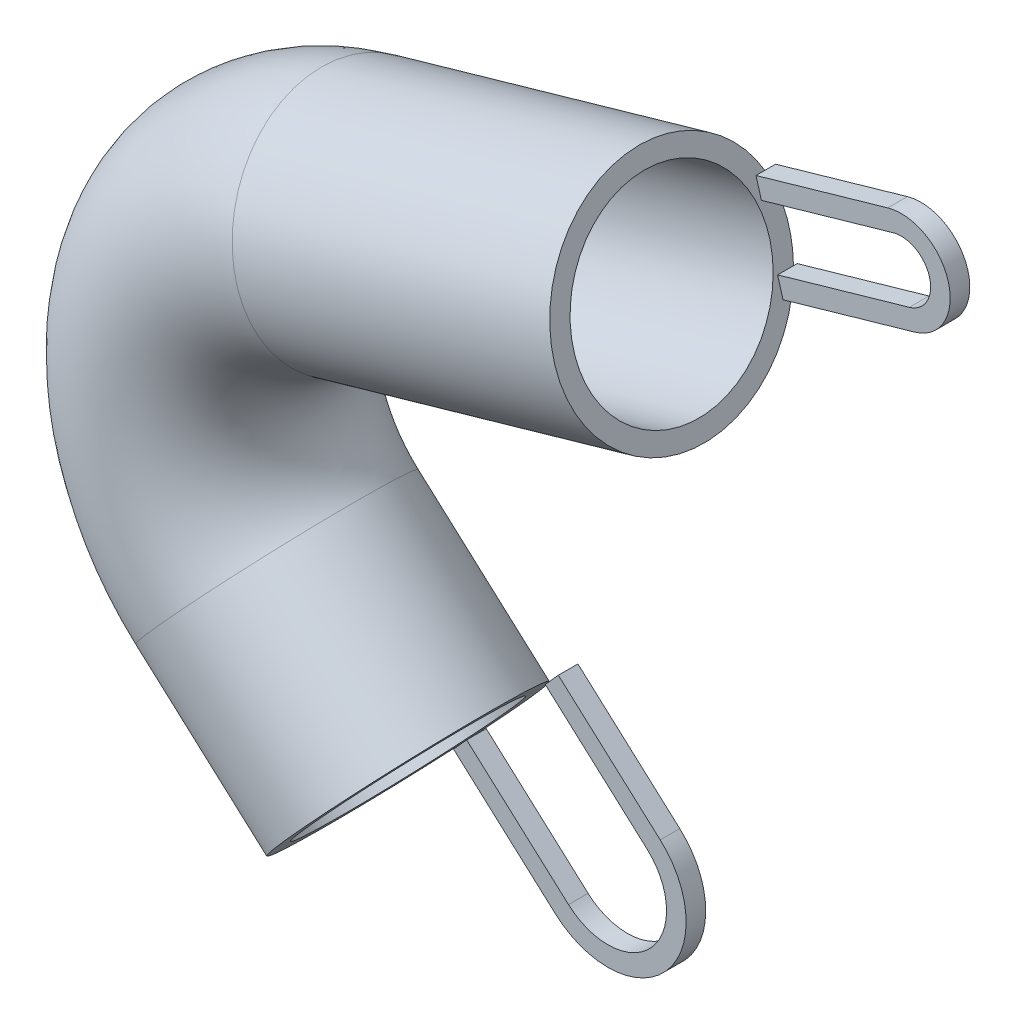
ISO-10303-21;
HEADER;
FILE_DESCRIPTION(('STEP AP214'),'2;1');
FILE_NAME('part.step','',(''),(''),'','','');
FILE_SCHEMA(('AUTOMOTIVE_DESIGN { 1 0 10303 214 1 1 1 1 }'));
ENDSEC;
DATA;
#1=APPLICATION_CONTEXT('core data for automotive mechanical design processes');
#2=APPLICATION_PROTOCOL_DEFINITION('international standard','automotive_design',2000,#1);
#3=PRODUCT_CONTEXT('',#1,'mechanical');
#4=PRODUCT('Part','Part','',(#3));
#5=PRODUCT_RELATED_PRODUCT_CATEGORY('part','',(#4));
#6=PRODUCT_DEFINITION_FORMATION('','',#4);
#7=PRODUCT_DEFINITION_CONTEXT('part definition',#1,'design');
#8=PRODUCT_DEFINITION('design','',#6,#7);
#9=PRODUCT_DEFINITION_SHAPE('','',#8);
#10=(LENGTH_UNIT() NAMED_UNIT(*) SI_UNIT(.MILLI.,.METRE.));
#11=(NAMED_UNIT(*) PLANE_ANGLE_UNIT() SI_UNIT($,.RADIAN.));
#12=(NAMED_UNIT(*) SI_UNIT($,.STERADIAN.) SOLID_ANGLE_UNIT());
#13=UNCERTAINTY_MEASURE_WITH_UNIT(LENGTH_MEASURE(1.E-05),#10,'distance_accuracy_value','');
#14=(GEOMETRIC_REPRESENTATION_CONTEXT(3) GLOBAL_UNCERTAINTY_ASSIGNED_CONTEXT((#13)) GLOBAL_UNIT_ASSIGNED_CONTEXT((#10,
#11,#12)) REPRESENTATION_CONTEXT('',''));
#15=CARTESIAN_POINT('',(0.,0.,0.));
#16=DIRECTION('',(0.,0.,1.));
#17=DIRECTION('',(1.,0.,0.));
#18=AXIS2_PLACEMENT_3D('',#15,#16,#17);
#19=CARTESIAN_POINT('',(0.,-13.4536240470737,0.));
#20=DIRECTION('',(0.743294146247166,-0.66896473162245,0.));
#21=DIRECTION('',(0.66896473162245,0.743294146247166,0.));
#22=AXIS2_PLACEMENT_3D('',#19,#20,#21);
#23=PLANE('',#22);
#24=DIRECTION('',(0.,0.,-1.));
#25=VECTOR('',#24,1.);
#26=CARTESIAN_POINT('',(-2.00689419486735,-15.6835064858152,-5.));
#27=LINE('',#26,#25);
#28=CARTESIAN_POINT('',(-2.00689419486735,-15.6835064858152,-5.));
#29=VERTEX_POINT('',#28);
#30=CARTESIAN_POINT('',(-2.00689419486735,-15.6835064858152,-5.19615242270663));
#31=VERTEX_POINT('',#30);
#32=EDGE_CURVE('E244',#29,#31,#27,.T.);
#33=ORIENTED_EDGE('',*,*,#32,.T.);
#34=CARTESIAN_POINT('',(0.,-13.4536240470737,0.));
#35=DIRECTION('',(0.743294146247166,-0.66896473162245,0.));
#36=DIRECTION('',(0.66896473162245,0.743294146247166,0.));
#37=AXIS2_PLACEMENT_3D('',#34,#35,#36);
#38=CIRCLE('',#37,6.);
#39=CARTESIAN_POINT('',(2.00689419486735,-11.2237416083322,-5.19615242270663));
#40=VERTEX_POINT('',#39);
#41=EDGE_CURVE('E338',#31,#40,#38,.T.);
#42=ORIENTED_EDGE('',*,*,#41,.T.);
#43=DIRECTION('',(0.,0.,-1.));
#44=VECTOR('',#43,1.);
#45=CARTESIAN_POINT('',(2.00689419486735,-11.2237416083322,-5.));
#46=LINE('',#45,#44);
#47=CARTESIAN_POINT('',(2.00689419486735,-11.2237416083322,-5.));
#48=VERTEX_POINT('',#47);
#49=EDGE_CURVE('E69',#48,#40,#46,.T.);
#50=ORIENTED_EDGE('',*,*,#49,.F.);
#51=DIRECTION('',(-0.66896473162245,-0.743294146247166,0.));
#52=VECTOR('',#51,1.);
#53=CARTESIAN_POINT('',(6.68964731622449,-6.02068258460205,-5.));
#54=LINE('',#53,#52);
#55=CARTESIAN_POINT('',(2.21870501277246,-10.9883962551043,-5.));
#56=VERTEX_POINT('',#55);
#57=EDGE_CURVE('E193',#56,#48,#54,.T.);
#58=ORIENTED_EDGE('',*,*,#57,.F.);
#59=CARTESIAN_POINT('',(-2.21870501277247,-15.9188518390431,-5.));
#60=VERTEX_POINT('',#59);
#61=EDGE_CURVE('E330',#56,#60,#38,.T.);
#62=ORIENTED_EDGE('',*,*,#61,.T.);
#63=EDGE_CURVE('E62',#29,#60,#54,.T.);
#64=ORIENTED_EDGE('',*,*,#63,.F.);
#65=EDGE_LOOP('',(#33,#42,#50,#58,#62,#64));
#66=FACE_BOUND('',#65,.T.);
#67=CARTESIAN_POINT('',(0.,-13.4536240470737,0.));
#68=DIRECTION('',(0.743294146247166,-0.66896473162245,0.));
#69=DIRECTION('',(0.66896473162245,0.743294146247166,0.));
#70=AXIS2_PLACEMENT_3D('',#67,#68,#69);
#71=CIRCLE('',#70,5.);
#72=CARTESIAN_POINT('',(-3.34482365811225,-17.1700947783095,0.));
#73=VERTEX_POINT('',#72);
#74=EDGE_CURVE('E298',#73,#73,#71,.T.);
#75=ORIENTED_EDGE('',*,*,#74,.F.);
#76=EDGE_LOOP('',(#75));
#77=FACE_BOUND('',#76,.T.);
#78=ADVANCED_FACE('F46',(#66,#77),#23,.T.);
#79=CARTESIAN_POINT('',(13.4605647921205,14.2666666688236,0.));
#80=DIRECTION('',(-0.961200154136361,-0.275851887229788,0.));
#81=DIRECTION('',(0.275851887229788,-0.961200154136361,0.));
#82=AXIS2_PLACEMENT_3D('',#79,#80,#81);
#83=PLANE('',#82);
#84=CARTESIAN_POINT('',(13.4605647921205,14.2666666688236,0.));
#85=DIRECTION('',(-0.961200154136361,-0.275851887229788,0.));
#86=DIRECTION('',(0.275851887229788,-0.961200154136361,0.));
#87=AXIS2_PLACEMENT_3D('',#84,#85,#86);
#88=CIRCLE('',#87,5.);
#89=CARTESIAN_POINT('',(12.0813053559716,19.0726674395054,0.));
#90=VERTEX_POINT('',#89);
#91=EDGE_CURVE('E327',#90,#90,#88,.T.);
#92=ORIENTED_EDGE('',*,*,#91,.T.);
#93=EDGE_LOOP('',(#92));
#94=FACE_BOUND('',#93,.T.);
#95=DIRECTION('',(0.,0.,-1.));
#96=VECTOR('',#95,1.);
#97=CARTESIAN_POINT('',(12.7709350740461,16.6696670541643,-5.));
#98=LINE('',#97,#96);
#99=CARTESIAN_POINT('',(12.7709350740461,16.6696670541643,-5.));
#100=VERTEX_POINT('',#99);
#101=CARTESIAN_POINT('',(12.7709350740461,16.6696670541643,-5.45435605731795));
#102=VERTEX_POINT('',#101);
#103=EDGE_CURVE('E310',#100,#102,#98,.T.);
#104=ORIENTED_EDGE('',*,*,#103,.T.);
#105=CARTESIAN_POINT('',(13.4605647921205,14.2666666688236,0.));
#106=DIRECTION('',(-0.961200154136361,-0.275851887229788,0.));
#107=DIRECTION('',(0.275851887229788,-0.961200154136361,0.));
#108=AXIS2_PLACEMENT_3D('',#105,#106,#107);
#109=CIRCLE('',#108,6.);
#110=CARTESIAN_POINT('',(14.1501945101949,11.8636662834829,-5.45435605731796));
#111=VERTEX_POINT('',#110);
#112=EDGE_CURVE('E55',#111,#102,#109,.T.);
#113=ORIENTED_EDGE('',*,*,#112,.F.);
#114=DIRECTION('',(0.,0.,-1.));
#115=VECTOR('',#114,1.);
#116=CARTESIAN_POINT('',(14.1501945101949,11.8636662834829,-5.));
#117=LINE('',#116,#115);
#118=CARTESIAN_POINT('',(14.1501945101949,11.8636662834829,-5.));
#119=VERTEX_POINT('',#118);
#120=EDGE_CURVE('E303',#119,#111,#117,.T.);
#121=ORIENTED_EDGE('',*,*,#120,.F.);
#122=DIRECTION('',(0.275851887229788,-0.961200154136361,0.));
#123=VECTOR('',#122,1.);
#124=CARTESIAN_POINT('',(16.2190836644184,4.65466512745994,-5.));
#125=LINE('',#124,#123);
#126=CARTESIAN_POINT('',(13.8743426229652,12.824866437619,-5.));
#127=VERTEX_POINT('',#126);
#128=EDGE_CURVE('E265',#127,#119,#125,.T.);
#129=ORIENTED_EDGE('',*,*,#128,.F.);
#130=DIRECTION('',(0.,0.,-1.));
#131=VECTOR('',#130,1.);
#132=CARTESIAN_POINT('',(13.8743426229652,12.824866437619,-5.));
#133=LINE('',#132,#131);
#134=CARTESIAN_POINT('',(13.8743426229652,12.824866437619,-5.80947501931112));
#135=VERTEX_POINT('',#134);
#136=EDGE_CURVE('E299',#127,#135,#133,.T.);
#137=ORIENTED_EDGE('',*,*,#136,.T.);
#138=CARTESIAN_POINT('',(13.0467869612758,15.7084669000281,-5.80947501931112));
#139=VERTEX_POINT('',#138);
#140=EDGE_CURVE('E54',#139,#135,#109,.T.);
#141=ORIENTED_EDGE('',*,*,#140,.F.);
#142=DIRECTION('',(0.,0.,-1.));
#143=VECTOR('',#142,1.);
#144=CARTESIAN_POINT('',(13.0467869612758,15.7084669000281,-5.));
#145=LINE('',#144,#143);
#146=CARTESIAN_POINT('',(13.0467869612758,15.7084669000281,-5.));
#147=VERTEX_POINT('',#146);
#148=EDGE_CURVE('E314',#147,#139,#145,.T.);
#149=ORIENTED_EDGE('',*,*,#148,.F.);
#150=EDGE_CURVE('E262',#100,#147,#125,.T.);
#151=ORIENTED_EDGE('',*,*,#150,.F.);
#152=EDGE_LOOP('',(#104,#113,#121,#129,#137,#141,#149,#151));
#153=FACE_BOUND('',#152,.T.);
#154=ADVANCED_FACE('F382',(#94,#153),#83,.F.);
#155=CARTESIAN_POINT('',(0.,-13.4536240470737,0.));
#156=DIRECTION('',(-0.743294146247166,0.66896473162245,0.));
#157=DIRECTION('',(-0.66896473162245,-0.743294146247166,0.));
#158=AXIS2_PLACEMENT_3D('',#155,#156,#157);
#159=CYLINDRICAL_SURFACE('',#158,6.);
#160=CARTESIAN_POINT('',(-6.6896473162245,-7.43294146247166,0.));
#161=DIRECTION('',(-0.743294146247166,0.66896473162245,0.));
#162=DIRECTION('',(-0.66896473162245,-0.743294146247166,0.));
#163=AXIS2_PLACEMENT_3D('',#160,#161,#162);
#164=CIRCLE('',#163,6.);
#165=CARTESIAN_POINT('',(-10.7034357059592,-11.8927063399547,0.));
#166=VERTEX_POINT('',#165);
#167=EDGE_CURVE('E331',#166,#166,#164,.F.);
#168=ORIENTED_EDGE('',*,*,#167,.T.);
#169=EDGE_LOOP('',(#168));
#170=FACE_BOUND('',#169,.T.);
#171=EDGE_CURVE('E335',#60,#31,#38,.T.);
#172=ORIENTED_EDGE('',*,*,#171,.F.);
#173=ORIENTED_EDGE('',*,*,#61,.F.);
#174=EDGE_CURVE('E343',#40,#56,#38,.T.);
#175=ORIENTED_EDGE('',*,*,#174,.F.);
#176=ORIENTED_EDGE('',*,*,#41,.F.);
#177=EDGE_LOOP('',(#172,#173,#175,#176));
#178=FACE_BOUND('',#177,.T.);
#179=ADVANCED_FACE('F387',(#170,#178),#159,.T.);
#180=CARTESIAN_POINT('',(0.,0.,0.));
#181=DIRECTION('',(0.,0.,-1.));
#182=DIRECTION('',(-1.,0.,0.));
#183=AXIS2_PLACEMENT_3D('',#180,#181,#182);
#184=TOROIDAL_SURFACE('',#183,10.,6.);
#185=CARTESIAN_POINT('',(-2.75851887229788,9.61200154136361,0.));
#186=DIRECTION('',(-0.961200154136361,-0.275851887229788,0.));
#187=DIRECTION('',(0.275851887229788,-0.961200154136361,0.));
#188=AXIS2_PLACEMENT_3D('',#185,#186,#187);
#189=CIRCLE('',#188,6.);
#190=CARTESIAN_POINT('',(-4.41363019567661,15.3792024661818,0.));
#191=VERTEX_POINT('',#190);
#192=EDGE_CURVE('E334',#191,#191,#189,.T.);
#193=CARTESIAN_POINT('',(0.,0.,0.));
#194=DIRECTION('',(0.,0.,-1.));
#195=DIRECTION('',(-1.,0.,0.));
#196=AXIS2_PLACEMENT_3D('',#193,#194,#195);
#197=CIRCLE('',#196,16.);
#198=EDGE_CURVE('',#166,#191,#197,.T.);
#199=ORIENTED_EDGE('',*,*,#167,.F.);
#200=ORIENTED_EDGE('',*,*,#192,.T.);
#201=ORIENTED_EDGE('',*,*,#198,.T.);
#202=ORIENTED_EDGE('',*,*,#198,.F.);
#203=EDGE_LOOP('',(#199,#201,#200,#202));
#204=FACE_BOUND('',#203,.T.);
#205=ADVANCED_FACE('F394',(#204),#184,.T.);
#206=CARTESIAN_POINT('',(-2.75851887229789,9.61200154136361,0.));
#207=DIRECTION('',(0.961200154136361,0.275851887229789,0.));
#208=DIRECTION('',(-0.275851887229789,0.961200154136361,0.));
#209=AXIS2_PLACEMENT_3D('',#206,#207,#208);
#210=CYLINDRICAL_SURFACE('',#209,6.);
#211=EDGE_CURVE('E12',#102,#139,#109,.T.);
#212=ORIENTED_EDGE('',*,*,#211,.T.);
#213=ORIENTED_EDGE('',*,*,#140,.T.);
#214=EDGE_CURVE('E457',#135,#111,#109,.T.);
#215=ORIENTED_EDGE('',*,*,#214,.T.);
#216=ORIENTED_EDGE('',*,*,#112,.T.);
#217=EDGE_LOOP('',(#212,#213,#215,#216));
#218=FACE_BOUND('',#217,.T.);
#219=ORIENTED_EDGE('',*,*,#192,.F.);
#220=EDGE_LOOP('',(#219));
#221=FACE_BOUND('',#220,.T.);
#222=ADVANCED_FACE('F48',(#218,#221),#210,.T.);
#223=CARTESIAN_POINT('',(0.,-13.4536240470737,0.));
#224=DIRECTION('',(-0.743294146247166,0.66896473162245,0.));
#225=DIRECTION('',(-0.66896473162245,-0.743294146247166,0.));
#226=AXIS2_PLACEMENT_3D('',#223,#224,#225);
#227=CYLINDRICAL_SURFACE('',#226,5.);
#228=CARTESIAN_POINT('',(-6.6896473162245,-7.43294146247166,0.));
#229=DIRECTION('',(0.743294146247166,-0.66896473162245,0.));
#230=DIRECTION('',(0.66896473162245,0.743294146247166,0.));
#231=AXIS2_PLACEMENT_3D('',#228,#229,#230);
#232=CIRCLE('',#231,5.);
#233=CARTESIAN_POINT('',(-10.0344709743367,-11.1494121937075,0.));
#234=VERTEX_POINT('',#233);
#235=EDGE_CURVE('E321',#234,#234,#232,.T.);
#236=CARTESIAN_POINT('',(-10.0344709743367,-11.1494121937075,0.));
#237=CARTESIAN_POINT('',(-9.96478714812608,-11.2121276372971,0.));
#238=CARTESIAN_POINT('',(-9.89510332191541,-11.2748430808867,0.));
#239=CARTESIAN_POINT('',(-9.75573566949406,-11.4002739680659,0.));
#240=CARTESIAN_POINT('',(-9.68605184328339,-11.4629894116555,0.));
#241=CARTESIAN_POINT('',(-9.54668419086205,-11.5884202988347,0.));
#242=CARTESIAN_POINT('',(-9.47700036465137,-11.6511357424243,0.));
#243=CARTESIAN_POINT('',(-9.33763271223003,-11.7765666296035,0.));
#244=CARTESIAN_POINT('',(-9.26794888601936,-11.8392820731931,0.));
#245=CARTESIAN_POINT('',(-9.12858123359801,-11.9647129603723,0.));
#246=CARTESIAN_POINT('',(-9.05889740738734,-12.027428403962,0.));
#247=CARTESIAN_POINT('',(-8.919529754966,-12.1528592911412,0.));
#248=CARTESIAN_POINT('',(-8.84984592875533,-12.2155747347308,0.));
#249=CARTESIAN_POINT('',(-8.71047827633398,-12.34100562191,0.));
#250=CARTESIAN_POINT('',(-8.64079445012331,-12.4037210654996,0.));
#251=CARTESIAN_POINT('',(-8.50142679770197,-12.5291519526788,0.));
#252=CARTESIAN_POINT('',(-8.4317429714913,-12.5918673962684,0.));
#253=CARTESIAN_POINT('',(-8.29237531906995,-12.7172982834476,0.));
#254=CARTESIAN_POINT('',(-8.22269149285928,-12.7800137270372,0.));
#255=CARTESIAN_POINT('',(-8.08332384043794,-12.9054446142164,0.));
#256=CARTESIAN_POINT('',(-8.01364001422727,-12.968160057806,0.));
#257=CARTESIAN_POINT('',(-7.87427236180592,-13.0935909449852,0.));
#258=CARTESIAN_POINT('',(-7.80458853559525,-13.1563063885748,0.));
#259=CARTESIAN_POINT('',(-7.66522088317391,-13.281737275754,0.));
#260=CARTESIAN_POINT('',(-7.59553705696323,-13.3444527193437,0.));
#261=CARTESIAN_POINT('',(-7.45616940454189,-13.4698836065229,0.));
#262=CARTESIAN_POINT('',(-7.38648557833122,-13.5325990501125,0.));
#263=CARTESIAN_POINT('',(-7.24711792590988,-13.6580299372917,0.));
#264=CARTESIAN_POINT('',(-7.1774340996992,-13.7207453808813,0.));
#265=CARTESIAN_POINT('',(-7.03806644727786,-13.8461762680605,0.));
#266=CARTESIAN_POINT('',(-6.96838262106719,-13.9088917116501,0.));
#267=CARTESIAN_POINT('',(-6.82901496864584,-14.0343225988293,0.));
#268=CARTESIAN_POINT('',(-6.75933114243517,-14.0970380424189,0.));
#269=CARTESIAN_POINT('',(-6.61996349001383,-14.2224689295981,0.));
#270=CARTESIAN_POINT('',(-6.55027966380316,-14.2851843731877,0.));
#271=CARTESIAN_POINT('',(-6.41091201138181,-14.4106152603669,0.));
#272=CARTESIAN_POINT('',(-6.34122818517114,-14.4733307039565,0.));
#273=CARTESIAN_POINT('',(-6.2018605327498,-14.5987615911357,0.));
#274=CARTESIAN_POINT('',(-6.13217670653913,-14.6614770347253,0.));
#275=CARTESIAN_POINT('',(-5.99280905411778,-14.7869079219046,0.));
#276=CARTESIAN_POINT('',(-5.92312522790711,-14.8496233654942,0.));
#277=CARTESIAN_POINT('',(-5.78375757548577,-14.9750542526734,0.));
#278=CARTESIAN_POINT('',(-5.7140737492751,-15.037769696263,0.));
#279=CARTESIAN_POINT('',(-5.57470609685375,-15.1632005834422,0.));
#280=CARTESIAN_POINT('',(-5.50502227064308,-15.2259160270318,0.));
#281=CARTESIAN_POINT('',(-5.36565461822174,-15.351346914211,0.));
#282=CARTESIAN_POINT('',(-5.29597079201106,-15.4140623578006,0.));
#283=CARTESIAN_POINT('',(-5.15660313958972,-15.5394932449798,0.));
#284=CARTESIAN_POINT('',(-5.08691931337905,-15.6022086885694,0.));
#285=CARTESIAN_POINT('',(-4.94755166095771,-15.7276395757486,0.));
#286=CARTESIAN_POINT('',(-4.87786783474703,-15.7903550193382,0.));
#287=CARTESIAN_POINT('',(-4.73850018232569,-15.9157859065174,0.));
#288=CARTESIAN_POINT('',(-4.66881635611502,-15.978501350107,0.));
#289=CARTESIAN_POINT('',(-4.52944870369367,-16.1039322372863,0.));
#290=CARTESIAN_POINT('',(-4.459764877483,-16.1666476808759,0.));
#291=CARTESIAN_POINT('',(-4.32039722506166,-16.2920785680551,0.));
#292=CARTESIAN_POINT('',(-4.25071339885099,-16.3547940116447,0.));
#293=CARTESIAN_POINT('',(-4.11134574642964,-16.4802248988239,0.));
#294=CARTESIAN_POINT('',(-4.04166192021897,-16.5429403424135,0.));
#295=CARTESIAN_POINT('',(-3.90229426779763,-16.6683712295927,0.));
#296=CARTESIAN_POINT('',(-3.83261044158696,-16.7310866731823,0.));
#297=CARTESIAN_POINT('',(-3.69324278916561,-16.8565175603615,0.));
#298=CARTESIAN_POINT('',(-3.62355896295494,-16.9192330039511,0.));
#299=CARTESIAN_POINT('',(-3.4841913105336,-17.0446638911303,0.));
#300=CARTESIAN_POINT('',(-3.41450748432293,-17.1073793347199,0.));
#301=CARTESIAN_POINT('',(-3.34482365811225,-17.1700947783095,0.));
#302=B_SPLINE_CURVE_WITH_KNOTS('',3,(#236,#237,#238,#239,#240,#241,#242,#243,#244,#245,#246,
#247,#248,#249,#250,#251,#252,#253,#254,#255,#256,#257,#258,#259,#260,#261,#262,#263,#264,#265,
#266,#267,#268,#269,#270,#271,#272,#273,#274,#275,#276,#277,#278,#279,#280,#281,#282,#283,#284,
#285,#286,#287,#288,#289,#290,#291,#292,#293,#294,#295,#296,#297,#298,#299,#300,#301),
.UNSPECIFIED.,.F.,.F.,(4,2,2,2,2,2,2,2,2,2,2,2,2,2,2,2,2,2,2,2,2,2,2,2,2,2,2,2,2,2,2,2,4),(0.,
0.281250000000001,0.5625,0.843750000000001,1.125,1.40625,1.6875,1.96875,2.25,2.53125,2.8125,
3.09375,3.375,3.65625,3.9375,4.21875,4.5,4.78125,5.0625,5.34375,5.625,5.90625,6.1875,6.46875,
6.75,7.03125,7.3125,7.59375,7.875,8.15625,8.4375,8.71875,9.),.UNSPECIFIED.);
#303=EDGE_CURVE('BSEAM402',#234,#73,#302,.T.);
#304=ORIENTED_EDGE('',*,*,#235,.F.);
#305=ORIENTED_EDGE('',*,*,#74,.T.);
#306=ORIENTED_EDGE('',*,*,#303,.T.);
#307=ORIENTED_EDGE('',*,*,#303,.F.);
#308=EDGE_LOOP('',(#304,#306,#305,#307));
#309=FACE_BOUND('',#308,.T.);
#310=ADVANCED_FACE('F402',(#309),#227,.F.);
#311=CARTESIAN_POINT('',(0.,0.,0.));
#312=DIRECTION('',(0.,0.,-1.));
#313=DIRECTION('',(-1.,0.,0.));
#314=AXIS2_PLACEMENT_3D('',#311,#312,#313);
#315=TOROIDAL_SURFACE('',#314,10.,5.);
#316=CARTESIAN_POINT('',(-2.75851887229788,9.6120015413636,0.));
#317=DIRECTION('',(-0.961200154136361,-0.275851887229788,0.));
#318=DIRECTION('',(0.275851887229788,-0.961200154136361,0.));
#319=AXIS2_PLACEMENT_3D('',#316,#317,#318);
#320=CIRCLE('',#319,5.);
#321=CARTESIAN_POINT('',(-4.13777830844682,14.4180023120454,0.));
#322=VERTEX_POINT('',#321);
#323=EDGE_CURVE('E324',#322,#322,#320,.T.);
#324=CARTESIAN_POINT('',(0.,0.,0.));
#325=DIRECTION('',(0.,0.,-1.));
#326=DIRECTION('',(-1.,0.,0.));
#327=AXIS2_PLACEMENT_3D('',#324,#325,#326);
#328=CIRCLE('',#327,15.);
#329=EDGE_CURVE('',#234,#322,#328,.T.);
#330=ORIENTED_EDGE('',*,*,#235,.T.);
#331=ORIENTED_EDGE('',*,*,#323,.F.);
#332=ORIENTED_EDGE('',*,*,#329,.T.);
#333=ORIENTED_EDGE('',*,*,#329,.F.);
#334=EDGE_LOOP('',(#330,#332,#331,#333));
#335=FACE_BOUND('',#334,.T.);
#336=ADVANCED_FACE('F411',(#335),#315,.F.);
#337=CARTESIAN_POINT('',(-2.75851887229789,9.61200154136361,0.));
#338=DIRECTION('',(0.961200154136361,0.275851887229789,0.));
#339=DIRECTION('',(-0.275851887229789,0.961200154136361,0.));
#340=AXIS2_PLACEMENT_3D('',#337,#338,#339);
#341=CYLINDRICAL_SURFACE('',#340,5.);
#342=CARTESIAN_POINT('',(12.0813053559716,19.0726674395054,0.));
#343=CARTESIAN_POINT('',(11.9123565678005,19.0241813444277,0.));
#344=CARTESIAN_POINT('',(11.7434077796295,18.9756952493499,0.));
#345=CARTESIAN_POINT('',(11.4055102032875,18.8787230591945,0.));
#346=CARTESIAN_POINT('',(11.2365614151164,18.8302369641168,0.));
#347=CARTESIAN_POINT('',(10.8986638387744,18.7332647739614,0.));
#348=CARTESIAN_POINT('',(10.7297150506034,18.6847786788837,0.));
#349=CARTESIAN_POINT('',(10.3918174742613,18.5878064887283,0.));
#350=CARTESIAN_POINT('',(10.2228686860903,18.5393203936506,0.));
#351=CARTESIAN_POINT('',(9.88497110974825,18.4423482034952,0.));
#352=CARTESIAN_POINT('',(9.71602232157722,18.3938621084175,0.));
#353=CARTESIAN_POINT('',(9.37812474523517,18.296889918262,0.));
#354=CARTESIAN_POINT('',(9.20917595706415,18.2484038231843,0.));
#355=CARTESIAN_POINT('',(8.8712783807221,18.1514316330289,0.));
#356=CARTESIAN_POINT('',(8.70232959255107,18.1029455379512,0.));
#357=CARTESIAN_POINT('',(8.36443201620902,18.0059733477958,0.));
#358=CARTESIAN_POINT('',(8.195483228038,17.9574872527181,0.));
#359=CARTESIAN_POINT('',(7.85758565169595,17.8605150625627,0.));
#360=CARTESIAN_POINT('',(7.68863686352492,17.812028967485,0.));
#361=CARTESIAN_POINT('',(7.35073928718287,17.7150567773295,0.));
#362=CARTESIAN_POINT('',(7.18179049901185,17.6665706822518,0.));
#363=CARTESIAN_POINT('',(6.8438929226698,17.5695984920964,0.));
#364=CARTESIAN_POINT('',(6.67494413449877,17.5211123970187,0.));
#365=CARTESIAN_POINT('',(6.33704655815672,17.4241402068633,0.));
#366=CARTESIAN_POINT('',(6.1680977699857,17.3756541117856,0.));
#367=CARTESIAN_POINT('',(5.83020019364365,17.2786819216302,0.));
#368=CARTESIAN_POINT('',(5.66125140547262,17.2301958265525,0.));
#369=CARTESIAN_POINT('',(5.32335382913057,17.1332236363971,0.));
#370=CARTESIAN_POINT('',(5.15440504095955,17.0847375413193,0.));
#371=CARTESIAN_POINT('',(4.8165074646175,16.9877653511639,0.));
#372=CARTESIAN_POINT('',(4.64755867644647,16.9392792560862,0.));
#373=CARTESIAN_POINT('',(4.30966110010443,16.8423070659308,0.));
#374=CARTESIAN_POINT('',(4.1407123119334,16.7938209708531,0.));
#375=CARTESIAN_POINT('',(3.80281473559135,16.6968487806977,0.));
#376=CARTESIAN_POINT('',(3.63386594742032,16.64836268562,0.));
#377=CARTESIAN_POINT('',(3.29596837107827,16.5513904954646,0.));
#378=CARTESIAN_POINT('',(3.12701958290725,16.5029044003868,0.));
#379=CARTESIAN_POINT('',(2.7891220065652,16.4059322102314,0.));
#380=CARTESIAN_POINT('',(2.62017321839418,16.3574461151537,0.));
#381=CARTESIAN_POINT('',(2.28227564205213,16.2604739249983,0.));
#382=CARTESIAN_POINT('',(2.1133268538811,16.2119878299206,0.));
#383=CARTESIAN_POINT('',(1.77542927753905,16.1150156397652,0.));
#384=CARTESIAN_POINT('',(1.60648048936803,16.0665295446875,0.));
#385=CARTESIAN_POINT('',(1.26858291302598,15.9695573545321,0.));
#386=CARTESIAN_POINT('',(1.09963412485495,15.9210712594544,0.));
#387=CARTESIAN_POINT('',(0.761736548512902,15.8240990692989,0.));
#388=CARTESIAN_POINT('',(0.592787760341877,15.7756129742212,0.));
#389=CARTESIAN_POINT('',(0.254890183999827,15.6786407840658,0.));
#390=CARTESIAN_POINT('',(0.0859413958288017,15.6301546889881,0.));
#391=CARTESIAN_POINT('',(-0.251956180513248,15.5331824988327,0.));
#392=CARTESIAN_POINT('',(-0.420904968684273,15.484696403755,0.));
#393=CARTESIAN_POINT('',(-0.758802545026323,15.3877242135996,0.));
#394=CARTESIAN_POINT('',(-0.927751333197348,15.3392381185219,0.));
#395=CARTESIAN_POINT('',(-1.2656489095394,15.2422659283664,0.));
#396=CARTESIAN_POINT('',(-1.43459769771042,15.1937798332887,0.));
#397=CARTESIAN_POINT('',(-1.77249527405247,15.0968076431333,0.));
#398=CARTESIAN_POINT('',(-1.9414440622235,15.0483215480556,0.));
#399=CARTESIAN_POINT('',(-2.27934163856555,14.9513493579002,0.));
#400=CARTESIAN_POINT('',(-2.44829042673657,14.9028632628225,0.));
#401=CARTESIAN_POINT('',(-2.78618800307862,14.8058910726671,0.));
#402=CARTESIAN_POINT('',(-2.95513679124965,14.7574049775894,0.));
#403=CARTESIAN_POINT('',(-3.2930343675917,14.660432787434,0.));
#404=CARTESIAN_POINT('',(-3.46198315576272,14.6119466923562,0.));
#405=CARTESIAN_POINT('',(-3.79988073210477,14.5149745022008,0.));
#406=CARTESIAN_POINT('',(-3.9688295202758,14.4664884071231,0.));
#407=CARTESIAN_POINT('',(-4.13777830844682,14.4180023120454,0.));
#408=B_SPLINE_CURVE_WITH_KNOTS('',3,(#342,#343,#344,#345,#346,#347,#348,#349,#350,#351,#352,
#353,#354,#355,#356,#357,#358,#359,#360,#361,#362,#363,#364,#365,#366,#367,#368,#369,#370,#371,
#372,#373,#374,#375,#376,#377,#378,#379,#380,#381,#382,#383,#384,#385,#386,#387,#388,#389,#390,
#391,#392,#393,#394,#395,#396,#397,#398,#399,#400,#401,#402,#403,#404,#405,#406,#407),
.UNSPECIFIED.,.F.,.F.,(4,2,2,2,2,2,2,2,2,2,2,2,2,2,2,2,2,2,2,2,2,2,2,2,2,2,2,2,2,2,2,2,4),(0.,
0.527305746188187,1.05461149237638,1.58191723856456,2.10922298475275,2.63652873094094,
3.16383447712912,3.69114022331731,4.2184459695055,4.74575171569369,5.27305746188188,
5.80036320807006,6.32766895425825,6.85497470044644,7.38228044663463,7.90958619282281,
8.436891939011,8.96419768519919,9.49150343138738,10.0188091775756,10.5461149237638,
11.0734206699519,11.6007264161401,12.1280321623283,12.6553379085165,13.1826436547047,
13.7099494008929,14.2372551470811,14.7645608932693,15.2918666394574,15.8191723856456,
16.3464781318338,16.873783878022),.UNSPECIFIED.);
#409=EDGE_CURVE('BSEAM396',#90,#322,#408,.T.);
#410=ORIENTED_EDGE('',*,*,#91,.F.);
#411=ORIENTED_EDGE('',*,*,#323,.T.);
#412=ORIENTED_EDGE('',*,*,#409,.T.);
#413=ORIENTED_EDGE('',*,*,#409,.F.);
#414=EDGE_LOOP('',(#410,#412,#411,#413));
#415=FACE_BOUND('',#414,.T.);
#416=ADVANCED_FACE('F396',(#415),#341,.F.);
#417=CARTESIAN_POINT('',(20.188965871075,16.1976298794321,-5.));
#418=DIRECTION('',(0.,0.,-1.));
#419=DIRECTION('',(-1.,0.,0.));
#420=AXIS2_PLACEMENT_3D('',#417,#418,#419);
#421=CYLINDRICAL_SURFACE('',#420,1.5);
#422=CARTESIAN_POINT('',(20.188965871075,16.1976298794321,-6.));
#423=DIRECTION('',(0.,0.,-1.));
#424=DIRECTION('',(-1.,0.,0.));
#425=AXIS2_PLACEMENT_3D('',#422,#423,#424);
#426=CIRCLE('',#425,1.5);
#427=CARTESIAN_POINT('',(19.7751880402304,17.6394301106366,-6.));
#428=VERTEX_POINT('',#427);
#429=CARTESIAN_POINT('',(20.6027437019197,14.7558296482275,-6.));
#430=VERTEX_POINT('',#429);
#431=EDGE_CURVE('E243',#428,#430,#426,.T.);
#432=ORIENTED_EDGE('',*,*,#431,.T.);
#433=DIRECTION('',(0.,0.,-1.));
#434=VECTOR('',#433,1.);
#435=CARTESIAN_POINT('',(20.6027437019197,14.7558296482275,-5.));
#436=LINE('',#435,#434);
#437=CARTESIAN_POINT('',(20.6027437019197,14.7558296482275,-5.));
#438=VERTEX_POINT('',#437);
#439=EDGE_CURVE('E296',#438,#430,#436,.T.);
#440=ORIENTED_EDGE('',*,*,#439,.F.);
#441=CARTESIAN_POINT('',(20.188965871075,16.1976298794321,-5.));
#442=DIRECTION('',(0.,0.,-1.));
#443=DIRECTION('',(-1.,0.,0.));
#444=AXIS2_PLACEMENT_3D('',#441,#442,#443);
#445=CIRCLE('',#444,1.5);
#446=CARTESIAN_POINT('',(19.7751880402304,17.6394301106366,-5.));
#447=VERTEX_POINT('',#446);
#448=EDGE_CURVE('E257',#447,#438,#445,.T.);
#449=ORIENTED_EDGE('',*,*,#448,.F.);
#450=DIRECTION('',(0.,0.,-1.));
#451=VECTOR('',#450,1.);
#452=CARTESIAN_POINT('',(19.7751880402304,17.6394301106366,-5.));
#453=LINE('',#452,#451);
#454=EDGE_CURVE('E276',#447,#428,#453,.T.);
#455=ORIENTED_EDGE('',*,*,#454,.T.);
#456=EDGE_LOOP('',(#432,#440,#449,#455));
#457=FACE_BOUND('',#456,.T.);
#458=ADVANCED_FACE('F414',(#457),#421,.F.);
#459=CARTESIAN_POINT('',(-2.3447410414532,8.17020131015908,-5.));
#460=DIRECTION('',(-0.275851887229788,0.961200154136361,0.));
#461=DIRECTION('',(-0.961200154136361,-0.275851887229788,0.));
#462=AXIS2_PLACEMENT_3D('',#459,#460,#461);
#463=PLANE('',#462);
#464=DIRECTION('',(0.961200154136361,0.275851887229788,0.));
#465=VECTOR('',#464,1.);
#466=CARTESIAN_POINT('',(-2.3447410414532,8.17020131015908,-6.));
#467=LINE('',#466,#465);
#468=CARTESIAN_POINT('',(13.8743426229652,12.824866437619,-6.));
#469=VERTEX_POINT('',#468);
#470=EDGE_CURVE('E260',#469,#430,#467,.T.);
#471=ORIENTED_EDGE('',*,*,#470,.F.);
#472=EDGE_CURVE('E302',#135,#469,#133,.T.);
#473=ORIENTED_EDGE('',*,*,#472,.F.);
#474=ORIENTED_EDGE('',*,*,#136,.F.);
#475=DIRECTION('',(0.961200154136361,0.275851887229788,0.));
#476=VECTOR('',#475,1.);
#477=CARTESIAN_POINT('',(-2.3447410414532,8.17020131015908,-5.));
#478=LINE('',#477,#476);
#479=EDGE_CURVE('E273',#127,#438,#478,.T.);
#480=ORIENTED_EDGE('',*,*,#479,.T.);
#481=ORIENTED_EDGE('',*,*,#439,.T.);
#482=EDGE_LOOP('',(#471,#473,#474,#480,#481));
#483=FACE_BOUND('',#482,.T.);
#484=ADVANCED_FACE('F466',(#483),#463,.T.);
#485=CARTESIAN_POINT('',(16.2190836644184,4.65466512745994,-5.));
#486=DIRECTION('',(0.961200154136361,0.275851887229788,0.));
#487=DIRECTION('',(-0.275851887229788,0.961200154136361,0.));
#488=AXIS2_PLACEMENT_3D('',#485,#486,#487);
#489=PLANE('',#488);
#490=CARTESIAN_POINT('',(14.1501945101949,11.8636662834829,-6.));
#491=VERTEX_POINT('',#490);
#492=EDGE_CURVE('E305',#111,#491,#117,.T.);
#493=ORIENTED_EDGE('',*,*,#492,.F.);
#494=ORIENTED_EDGE('',*,*,#214,.F.);
#495=ORIENTED_EDGE('',*,*,#472,.T.);
#496=DIRECTION('',(0.275851887229788,-0.961200154136361,0.));
#497=VECTOR('',#496,1.);
#498=CARTESIAN_POINT('',(16.2190836644184,4.65466512745994,-6.));
#499=LINE('',#498,#497);
#500=EDGE_CURVE('E285',#469,#491,#499,.T.);
#501=ORIENTED_EDGE('',*,*,#500,.T.);
#502=EDGE_LOOP('',(#493,#494,#495,#501));
#503=FACE_BOUND('',#502,.T.);
#504=ADVANCED_FACE('F456',(#503),#489,.F.);
#505=CARTESIAN_POINT('',(-2.06888915422347,7.20900115602292,-5.));
#506=DIRECTION('',(0.275851887229788,-0.961200154136361,0.));
#507=DIRECTION('',(0.961200154136361,0.275851887229788,0.));
#508=AXIS2_PLACEMENT_3D('',#505,#506,#507);
#509=PLANE('',#508);
#510=DIRECTION('',(-0.961200154136361,-0.275851887229788,0.));
#511=VECTOR('',#510,1.);
#512=CARTESIAN_POINT('',(-2.06888915422347,7.20900115602292,-6.));
#513=LINE('',#512,#511);
#514=CARTESIAN_POINT('',(20.8785955891495,13.7946294940914,-6.));
#515=VERTEX_POINT('',#514);
#516=EDGE_CURVE('E291',#515,#491,#513,.T.);
#517=ORIENTED_EDGE('',*,*,#516,.F.);
#518=DIRECTION('',(0.,0.,-1.));
#519=VECTOR('',#518,1.);
#520=CARTESIAN_POINT('',(20.8785955891495,13.7946294940914,-5.));
#521=LINE('',#520,#519);
#522=CARTESIAN_POINT('',(20.8785955891495,13.7946294940914,-5.));
#523=VERTEX_POINT('',#522);
#524=EDGE_CURVE('E306',#523,#515,#521,.T.);
#525=ORIENTED_EDGE('',*,*,#524,.F.);
#526=DIRECTION('',(-0.961200154136361,-0.275851887229788,0.));
#527=VECTOR('',#526,1.);
#528=CARTESIAN_POINT('',(-2.06888915422347,7.20900115602292,-5.));
#529=LINE('',#528,#527);
#530=EDGE_CURVE('E270',#523,#119,#529,.T.);
#531=ORIENTED_EDGE('',*,*,#530,.T.);
#532=ORIENTED_EDGE('',*,*,#120,.T.);
#533=ORIENTED_EDGE('',*,*,#492,.T.);
#534=EDGE_LOOP('',(#517,#525,#531,#532,#533));
#535=FACE_BOUND('',#534,.T.);
#536=ADVANCED_FACE('F453',(#535),#509,.T.);
#537=CARTESIAN_POINT('',(20.188965871075,16.1976298794321,-5.));
#538=DIRECTION('',(0.,0.,-1.));
#539=DIRECTION('',(-1.,0.,0.));
#540=AXIS2_PLACEMENT_3D('',#537,#538,#539);
#541=CYLINDRICAL_SURFACE('',#540,2.4999999999998);
#542=CARTESIAN_POINT('',(20.188965871075,16.1976298794321,-6.));
#543=DIRECTION('',(0.,0.,-1.));
#544=DIRECTION('',(-1.,0.,0.));
#545=AXIS2_PLACEMENT_3D('',#542,#543,#544);
#546=CIRCLE('',#545,2.4999999999998);
#547=CARTESIAN_POINT('',(19.4993361530006,18.6006302647728,-6.));
#548=VERTEX_POINT('',#547);
#549=EDGE_CURVE('E288',#548,#515,#546,.T.);
#550=ORIENTED_EDGE('',*,*,#549,.F.);
#551=DIRECTION('',(0.,0.,-1.));
#552=VECTOR('',#551,1.);
#553=CARTESIAN_POINT('',(19.4993361530006,18.6006302647728,-5.));
#554=LINE('',#553,#552);
#555=CARTESIAN_POINT('',(19.4993361530006,18.6006302647728,-5.));
#556=VERTEX_POINT('',#555);
#557=EDGE_CURVE('E308',#556,#548,#554,.T.);
#558=ORIENTED_EDGE('',*,*,#557,.F.);
#559=CARTESIAN_POINT('',(20.188965871075,16.1976298794321,-5.));
#560=DIRECTION('',(0.,0.,-1.));
#561=DIRECTION('',(-1.,0.,0.));
#562=AXIS2_PLACEMENT_3D('',#559,#560,#561);
#563=CIRCLE('',#562,2.4999999999998);
#564=EDGE_CURVE('E267',#556,#523,#563,.T.);
#565=ORIENTED_EDGE('',*,*,#564,.T.);
#566=ORIENTED_EDGE('',*,*,#524,.T.);
#567=EDGE_LOOP('',(#550,#558,#565,#566));
#568=FACE_BOUND('',#567,.T.);
#569=ADVANCED_FACE('F465',(#568),#541,.T.);
#570=CARTESIAN_POINT('',(-3.4481485903723,12.0150019267043,-5.));
#571=DIRECTION('',(0.275851887229789,-0.961200154136361,0.));
#572=DIRECTION('',(0.961200154136361,0.275851887229789,0.));
#573=AXIS2_PLACEMENT_3D('',#570,#571,#572);
#574=PLANE('',#573);
#575=DIRECTION('',(-0.961200154136361,-0.275851887229789,0.));
#576=VECTOR('',#575,1.);
#577=CARTESIAN_POINT('',(-3.4481485903723,12.0150019267043,-6.));
#578=LINE('',#577,#576);
#579=CARTESIAN_POINT('',(12.7709350740461,16.6696670541643,-6.));
#580=VERTEX_POINT('',#579);
#581=EDGE_CURVE('E284',#548,#580,#578,.T.);
#582=ORIENTED_EDGE('',*,*,#581,.T.);
#583=EDGE_CURVE('E313',#102,#580,#98,.T.);
#584=ORIENTED_EDGE('',*,*,#583,.F.);
#585=ORIENTED_EDGE('',*,*,#103,.F.);
#586=DIRECTION('',(-0.961200154136361,-0.275851887229789,0.));
#587=VECTOR('',#586,1.);
#588=CARTESIAN_POINT('',(-3.4481485903723,12.0150019267043,-5.));
#589=LINE('',#588,#587);
#590=EDGE_CURVE('E264',#556,#100,#589,.T.);
#591=ORIENTED_EDGE('',*,*,#590,.F.);
#592=ORIENTED_EDGE('',*,*,#557,.T.);
#593=EDGE_LOOP('',(#582,#584,#585,#591,#592));
#594=FACE_BOUND('',#593,.T.);
#595=ADVANCED_FACE('F426',(#594),#574,.F.);
#596=CARTESIAN_POINT('',(13.0467869612758,15.7084669000281,-6.));
#597=VERTEX_POINT('',#596);
#598=EDGE_CURVE('E316',#139,#597,#145,.T.);
#599=ORIENTED_EDGE('',*,*,#598,.F.);
#600=ORIENTED_EDGE('',*,*,#211,.F.);
#601=ORIENTED_EDGE('',*,*,#583,.T.);
#602=EDGE_CURVE('E281',#580,#597,#499,.T.);
#603=ORIENTED_EDGE('',*,*,#602,.T.);
#604=EDGE_LOOP('',(#599,#600,#601,#603));
#605=FACE_BOUND('',#604,.T.);
#606=ADVANCED_FACE('F423',(#605),#489,.F.);
#607=CARTESIAN_POINT('',(-3.17229670314257,11.0538017725682,-5.));
#608=DIRECTION('',(-0.275851887229789,0.961200154136361,0.));
#609=DIRECTION('',(-0.961200154136361,-0.275851887229789,0.));
#610=AXIS2_PLACEMENT_3D('',#607,#608,#609);
#611=PLANE('',#610);
#612=DIRECTION('',(0.961200154136361,0.275851887229789,0.));
#613=VECTOR('',#612,1.);
#614=CARTESIAN_POINT('',(-3.17229670314257,11.0538017725682,-6.));
#615=LINE('',#614,#613);
#616=EDGE_CURVE('E279',#597,#428,#615,.T.);
#617=ORIENTED_EDGE('',*,*,#616,.T.);
#618=ORIENTED_EDGE('',*,*,#454,.F.);
#619=DIRECTION('',(0.961200154136361,0.275851887229789,0.));
#620=VECTOR('',#619,1.);
#621=CARTESIAN_POINT('',(-3.17229670314257,11.0538017725682,-5.));
#622=LINE('',#621,#620);
#623=EDGE_CURVE('E259',#147,#447,#622,.T.);
#624=ORIENTED_EDGE('',*,*,#623,.F.);
#625=ORIENTED_EDGE('',*,*,#148,.T.);
#626=ORIENTED_EDGE('',*,*,#598,.T.);
#627=EDGE_LOOP('',(#617,#618,#624,#625,#626));
#628=FACE_BOUND('',#627,.T.);
#629=ADVANCED_FACE('F440',(#628),#611,.F.);
#630=CARTESIAN_POINT('',(0.,0.,-5.));
#631=DIRECTION('',(0.,0.,-1.));
#632=DIRECTION('',(-1.,0.,0.));
#633=AXIS2_PLACEMENT_3D('',#630,#631,#632);
#634=PLANE('',#633);
#635=ORIENTED_EDGE('',*,*,#448,.T.);
#636=ORIENTED_EDGE('',*,*,#479,.F.);
#637=ORIENTED_EDGE('',*,*,#128,.T.);
#638=ORIENTED_EDGE('',*,*,#530,.F.);
#639=ORIENTED_EDGE('',*,*,#564,.F.);
#640=ORIENTED_EDGE('',*,*,#590,.T.);
#641=ORIENTED_EDGE('',*,*,#150,.T.);
#642=ORIENTED_EDGE('',*,*,#623,.T.);
#643=EDGE_LOOP('',(#635,#636,#637,#638,#639,#640,#641,#642));
#644=FACE_BOUND('',#643,.T.);
#645=ADVANCED_FACE('F436',(#644),#634,.F.);
#646=CARTESIAN_POINT('',(0.,0.,-6.));
#647=DIRECTION('',(0.,0.,-1.));
#648=DIRECTION('',(-1.,0.,0.));
#649=AXIS2_PLACEMENT_3D('',#646,#647,#648);
#650=PLANE('',#649);
#651=ORIENTED_EDGE('',*,*,#431,.F.);
#652=ORIENTED_EDGE('',*,*,#616,.F.);
#653=ORIENTED_EDGE('',*,*,#602,.F.);
#654=ORIENTED_EDGE('',*,*,#581,.F.);
#655=ORIENTED_EDGE('',*,*,#549,.T.);
#656=ORIENTED_EDGE('',*,*,#516,.T.);
#657=ORIENTED_EDGE('',*,*,#500,.F.);
#658=ORIENTED_EDGE('',*,*,#470,.T.);
#659=EDGE_LOOP('',(#651,#652,#653,#654,#655,#656,#657,#658));
#660=FACE_BOUND('',#659,.T.);
#661=ADVANCED_FACE('F462',(#660),#650,.T.);
#662=CARTESIAN_POINT('',(5.20305902373016,-18.1363771684309,-5.));
#663=DIRECTION('',(0.,0.,-1.));
#664=DIRECTION('',(-1.,0.,0.));
#665=AXIS2_PLACEMENT_3D('',#662,#663,#664);
#666=CYLINDRICAL_SURFACE('',#665,3.);
#667=CARTESIAN_POINT('',(5.20305902373016,-18.1363771684309,-6.));
#668=DIRECTION('',(0.,0.,-1.));
#669=DIRECTION('',(-1.,0.,0.));
#670=AXIS2_PLACEMENT_3D('',#667,#668,#669);
#671=CIRCLE('',#670,3.);
#672=CARTESIAN_POINT('',(7.20995321859751,-15.9064947296894,-6.));
#673=VERTEX_POINT('',#672);
#674=CARTESIAN_POINT('',(3.19616482886281,-20.3662596071724,-6.));
#675=VERTEX_POINT('',#674);
#676=EDGE_CURVE('E228',#673,#675,#671,.T.);
#677=ORIENTED_EDGE('',*,*,#676,.T.);
#678=DIRECTION('',(0.,0.,-1.));
#679=VECTOR('',#678,1.);
#680=CARTESIAN_POINT('',(3.19616482886281,-20.3662596071724,-5.));
#681=LINE('',#680,#679);
#682=CARTESIAN_POINT('',(3.19616482886281,-20.3662596071724,-5.));
#683=VERTEX_POINT('',#682);
#684=EDGE_CURVE('E208',#683,#675,#681,.T.);
#685=ORIENTED_EDGE('',*,*,#684,.F.);
#686=CARTESIAN_POINT('',(5.20305902373016,-18.1363771684309,-5.));
#687=DIRECTION('',(0.,0.,-1.));
#688=DIRECTION('',(-1.,0.,0.));
#689=AXIS2_PLACEMENT_3D('',#686,#687,#688);
#690=CIRCLE('',#689,3.);
#691=CARTESIAN_POINT('',(7.20995321859751,-15.9064947296894,-5.));
#692=VERTEX_POINT('',#691);
#693=EDGE_CURVE('E190',#692,#683,#690,.T.);
#694=ORIENTED_EDGE('',*,*,#693,.F.);
#695=DIRECTION('',(0.,0.,-1.));
#696=VECTOR('',#695,1.);
#697=CARTESIAN_POINT('',(7.20995321859751,-15.9064947296894,-5.));
#698=LINE('',#697,#696);
#699=EDGE_CURVE('E197',#692,#673,#698,.T.);
#700=ORIENTED_EDGE('',*,*,#699,.T.);
#701=EDGE_LOOP('',(#677,#685,#694,#700));
#702=FACE_BOUND('',#701,.T.);
#703=ADVANCED_FACE('F207',(#702),#666,.F.);
#704=CARTESIAN_POINT('',(-8.69654151109185,-9.66282390121314,-5.));
#705=DIRECTION('',(0.668964731622451,0.743294146247166,0.));
#706=DIRECTION('',(-0.743294146247166,0.668964731622451,0.));
#707=AXIS2_PLACEMENT_3D('',#704,#705,#706);
#708=PLANE('',#707);
#709=DIRECTION('',(0.743294146247165,-0.668964731622451,0.));
#710=VECTOR('',#709,1.);
#711=CARTESIAN_POINT('',(-8.69654151109185,-9.66282390121314,-6.));
#712=LINE('',#711,#710);
#713=CARTESIAN_POINT('',(-2.00689419486735,-15.6835064858152,-6.));
#714=VERTEX_POINT('',#713);
#715=EDGE_CURVE('E210',#714,#675,#712,.T.);
#716=ORIENTED_EDGE('',*,*,#715,.F.);
#717=EDGE_CURVE('E246',#31,#714,#27,.T.);
#718=ORIENTED_EDGE('',*,*,#717,.F.);
#719=ORIENTED_EDGE('',*,*,#32,.F.);
#720=DIRECTION('',(0.743294146247165,-0.668964731622451,0.));
#721=VECTOR('',#720,1.);
#722=CARTESIAN_POINT('',(-8.69654151109185,-9.66282390121314,-5.));
#723=LINE('',#722,#721);
#724=EDGE_CURVE('E205',#29,#683,#723,.T.);
#725=ORIENTED_EDGE('',*,*,#724,.T.);
#726=ORIENTED_EDGE('',*,*,#684,.T.);
#727=EDGE_LOOP('',(#716,#718,#719,#725,#726));
#728=FACE_BOUND('',#727,.T.);
#729=ADVANCED_FACE('F365',(#728),#708,.T.);
#730=CARTESIAN_POINT('',(6.68964731622449,-6.02068258460205,-5.));
#731=DIRECTION('',(0.743294146247166,-0.66896473162245,0.));
#732=DIRECTION('',(0.66896473162245,0.743294146247166,0.));
#733=AXIS2_PLACEMENT_3D('',#730,#731,#732);
#734=PLANE('',#733);
#735=CARTESIAN_POINT('',(-2.6758589264898,-16.4268006320624,-5.));
#736=VERTEX_POINT('',#735);
#737=EDGE_CURVE('E226',#60,#736,#54,.T.);
#738=ORIENTED_EDGE('',*,*,#737,.F.);
#739=ORIENTED_EDGE('',*,*,#171,.T.);
#740=ORIENTED_EDGE('',*,*,#717,.T.);
#741=DIRECTION('',(-0.66896473162245,-0.743294146247166,0.));
#742=VECTOR('',#741,1.);
#743=CARTESIAN_POINT('',(6.68964731622449,-6.02068258460205,-6.));
#744=LINE('',#743,#742);
#745=CARTESIAN_POINT('',(-2.6758589264898,-16.4268006320624,-6.));
#746=VERTEX_POINT('',#745);
#747=EDGE_CURVE('E213',#714,#746,#744,.T.);
#748=ORIENTED_EDGE('',*,*,#747,.T.);
#749=DIRECTION('',(0.,0.,-1.));
#750=VECTOR('',#749,1.);
#751=CARTESIAN_POINT('',(-2.6758589264898,-16.4268006320624,-5.));
#752=LINE('',#751,#750);
#753=EDGE_CURVE('E247',#736,#746,#752,.T.);
#754=ORIENTED_EDGE('',*,*,#753,.F.);
#755=EDGE_LOOP('',(#738,#739,#740,#748,#754));
#756=FACE_BOUND('',#755,.T.);
#757=ADVANCED_FACE('F367',(#756),#734,.F.);
#758=CARTESIAN_POINT('',(-9.36550624271429,-10.4061180474603,-5.));
#759=DIRECTION('',(-0.66896473162245,-0.743294146247166,0.));
#760=DIRECTION('',(0.743294146247166,-0.66896473162245,0.));
#761=AXIS2_PLACEMENT_3D('',#758,#759,#760);
#762=PLANE('',#761);
#763=DIRECTION('',(-0.743294146247166,0.66896473162245,0.));
#764=VECTOR('',#763,1.);
#765=CARTESIAN_POINT('',(-9.36550624271429,-10.4061180474603,-6.));
#766=LINE('',#765,#764);
#767=CARTESIAN_POINT('',(2.52720009724036,-21.1095537534195,-6.));
#768=VERTEX_POINT('',#767);
#769=EDGE_CURVE('E239',#768,#746,#766,.T.);
#770=ORIENTED_EDGE('',*,*,#769,.F.);
#771=DIRECTION('',(0.,0.,-1.));
#772=VECTOR('',#771,1.);
#773=CARTESIAN_POINT('',(2.52720009724036,-21.1095537534195,-5.));
#774=LINE('',#773,#772);
#775=CARTESIAN_POINT('',(2.52720009724036,-21.1095537534195,-5.));
#776=VERTEX_POINT('',#775);
#777=EDGE_CURVE('E249',#776,#768,#774,.T.);
#778=ORIENTED_EDGE('',*,*,#777,.F.);
#779=DIRECTION('',(-0.743294146247166,0.66896473162245,0.));
#780=VECTOR('',#779,1.);
#781=CARTESIAN_POINT('',(-9.36550624271429,-10.4061180474603,-5.));
#782=LINE('',#781,#780);
#783=EDGE_CURVE('E223',#776,#736,#782,.T.);
#784=ORIENTED_EDGE('',*,*,#783,.T.);
#785=ORIENTED_EDGE('',*,*,#753,.T.);
#786=EDGE_LOOP('',(#770,#778,#784,#785));
#787=FACE_BOUND('',#786,.T.);
#788=ADVANCED_FACE('F370',(#787),#762,.T.);
#789=CARTESIAN_POINT('',(5.20305902373016,-18.1363771684309,-5.));
#790=DIRECTION('',(0.,0.,-1.));
#791=DIRECTION('',(-1.,0.,0.));
#792=AXIS2_PLACEMENT_3D('',#789,#790,#791);
#793=CYLINDRICAL_SURFACE('',#792,4.);
#794=CARTESIAN_POINT('',(5.20305902373016,-18.1363771684309,-6.));
#795=DIRECTION('',(0.,0.,-1.));
#796=DIRECTION('',(-1.,0.,0.));
#797=AXIS2_PLACEMENT_3D('',#794,#795,#796);
#798=CIRCLE('',#797,4.);
#799=CARTESIAN_POINT('',(7.87891795021996,-15.1632005834422,-6.));
#800=VERTEX_POINT('',#799);
#801=EDGE_CURVE('E236',#800,#768,#798,.T.);
#802=ORIENTED_EDGE('',*,*,#801,.F.);
#803=DIRECTION('',(0.,0.,-1.));
#804=VECTOR('',#803,1.);
#805=CARTESIAN_POINT('',(7.87891795021996,-15.1632005834422,-5.));
#806=LINE('',#805,#804);
#807=CARTESIAN_POINT('',(7.87891795021996,-15.1632005834422,-5.));
#808=VERTEX_POINT('',#807);
#809=EDGE_CURVE('E251',#808,#800,#806,.T.);
#810=ORIENTED_EDGE('',*,*,#809,.F.);
#811=CARTESIAN_POINT('',(5.20305902373016,-18.1363771684309,-5.));
#812=DIRECTION('',(0.,0.,-1.));
#813=DIRECTION('',(-1.,0.,0.));
#814=AXIS2_PLACEMENT_3D('',#811,#812,#813);
#815=CIRCLE('',#814,4.);
#816=EDGE_CURVE('E220',#808,#776,#815,.T.);
#817=ORIENTED_EDGE('',*,*,#816,.T.);
#818=ORIENTED_EDGE('',*,*,#777,.T.);
#819=EDGE_LOOP('',(#802,#810,#817,#818));
#820=FACE_BOUND('',#819,.T.);
#821=ADVANCED_FACE('F372',(#820),#793,.T.);
#822=CARTESIAN_POINT('',(-4.0137883897347,-4.45976487748299,-5.));
#823=DIRECTION('',(-0.66896473162245,-0.743294146247166,0.));
#824=DIRECTION('',(0.743294146247166,-0.66896473162245,0.));
#825=AXIS2_PLACEMENT_3D('',#822,#823,#824);
#826=PLANE('',#825);
#827=DIRECTION('',(-0.743294146247166,0.66896473162245,0.));
#828=VECTOR('',#827,1.);
#829=CARTESIAN_POINT('',(-4.0137883897347,-4.45976487748299,-6.));
#830=LINE('',#829,#828);
#831=CARTESIAN_POINT('',(2.6758589264898,-10.480447462085,-6.));
#832=VERTEX_POINT('',#831);
#833=EDGE_CURVE('E234',#800,#832,#830,.T.);
#834=ORIENTED_EDGE('',*,*,#833,.T.);
#835=DIRECTION('',(0.,0.,-1.));
#836=VECTOR('',#835,1.);
#837=CARTESIAN_POINT('',(2.6758589264898,-10.480447462085,-5.));
#838=LINE('',#837,#836);
#839=CARTESIAN_POINT('',(2.6758589264898,-10.480447462085,-5.));
#840=VERTEX_POINT('',#839);
#841=EDGE_CURVE('E253',#840,#832,#838,.T.);
#842=ORIENTED_EDGE('',*,*,#841,.F.);
#843=DIRECTION('',(-0.743294146247166,0.66896473162245,0.));
#844=VECTOR('',#843,1.);
#845=CARTESIAN_POINT('',(-4.0137883897347,-4.45976487748299,-5.));
#846=LINE('',#845,#844);
#847=EDGE_CURVE('E218',#808,#840,#846,.T.);
#848=ORIENTED_EDGE('',*,*,#847,.F.);
#849=ORIENTED_EDGE('',*,*,#809,.T.);
#850=EDGE_LOOP('',(#834,#842,#848,#849));
#851=FACE_BOUND('',#850,.T.);
#852=ADVANCED_FACE('F355',(#851),#826,.F.);
#853=CARTESIAN_POINT('',(2.00689419486735,-11.2237416083322,-6.));
#854=VERTEX_POINT('',#853);
#855=EDGE_CURVE('E204',#40,#854,#46,.T.);
#856=ORIENTED_EDGE('',*,*,#855,.F.);
#857=ORIENTED_EDGE('',*,*,#174,.T.);
#858=EDGE_CURVE('E216',#840,#56,#54,.T.);
#859=ORIENTED_EDGE('',*,*,#858,.F.);
#860=ORIENTED_EDGE('',*,*,#841,.T.);
#861=EDGE_CURVE('E231',#832,#854,#744,.T.);
#862=ORIENTED_EDGE('',*,*,#861,.T.);
#863=EDGE_LOOP('',(#856,#857,#859,#860,#862));
#864=FACE_BOUND('',#863,.T.);
#865=ADVANCED_FACE('F348',(#864),#734,.F.);
#866=CARTESIAN_POINT('',(-4.68275312135715,-5.20305902373016,-5.));
#867=DIRECTION('',(0.66896473162245,0.743294146247166,0.));
#868=DIRECTION('',(-0.743294146247166,0.66896473162245,0.));
#869=AXIS2_PLACEMENT_3D('',#866,#867,#868);
#870=PLANE('',#869);
#871=DIRECTION('',(0.743294146247166,-0.66896473162245,0.));
#872=VECTOR('',#871,1.);
#873=CARTESIAN_POINT('',(-4.68275312135715,-5.20305902373016,-6.));
#874=LINE('',#873,#872);
#875=EDGE_CURVE('E200',#854,#673,#874,.T.);
#876=ORIENTED_EDGE('',*,*,#875,.T.);
#877=ORIENTED_EDGE('',*,*,#699,.F.);
#878=DIRECTION('',(0.743294146247166,-0.66896473162245,0.));
#879=VECTOR('',#878,1.);
#880=CARTESIAN_POINT('',(-4.68275312135715,-5.20305902373016,-5.));
#881=LINE('',#880,#879);
#882=EDGE_CURVE('E185',#48,#692,#881,.T.);
#883=ORIENTED_EDGE('',*,*,#882,.F.);
#884=ORIENTED_EDGE('',*,*,#49,.T.);
#885=ORIENTED_EDGE('',*,*,#855,.T.);
#886=EDGE_LOOP('',(#876,#877,#883,#884,#885));
#887=FACE_BOUND('',#886,.T.);
#888=ADVANCED_FACE('F198',(#887),#870,.F.);
#889=CARTESIAN_POINT('',(0.,0.,-5.));
#890=DIRECTION('',(0.,0.,-1.));
#891=DIRECTION('',(-1.,0.,0.));
#892=AXIS2_PLACEMENT_3D('',#889,#890,#891);
#893=PLANE('',#892);
#894=ORIENTED_EDGE('',*,*,#693,.T.);
#895=ORIENTED_EDGE('',*,*,#724,.F.);
#896=ORIENTED_EDGE('',*,*,#63,.T.);
#897=ORIENTED_EDGE('',*,*,#737,.T.);
#898=ORIENTED_EDGE('',*,*,#783,.F.);
#899=ORIENTED_EDGE('',*,*,#816,.F.);
#900=ORIENTED_EDGE('',*,*,#847,.T.);
#901=ORIENTED_EDGE('',*,*,#858,.T.);
#902=ORIENTED_EDGE('',*,*,#57,.T.);
#903=ORIENTED_EDGE('',*,*,#882,.T.);
#904=EDGE_LOOP('',(#894,#895,#896,#897,#898,#899,#900,#901,#902,#903));
#905=FACE_BOUND('',#904,.T.);
#906=ADVANCED_FACE('F187',(#905),#893,.F.);
#907=CARTESIAN_POINT('',(0.,0.,-6.));
#908=DIRECTION('',(0.,0.,-1.));
#909=DIRECTION('',(-1.,0.,0.));
#910=AXIS2_PLACEMENT_3D('',#907,#908,#909);
#911=PLANE('',#910);
#912=ORIENTED_EDGE('',*,*,#676,.F.);
#913=ORIENTED_EDGE('',*,*,#875,.F.);
#914=ORIENTED_EDGE('',*,*,#861,.F.);
#915=ORIENTED_EDGE('',*,*,#833,.F.);
#916=ORIENTED_EDGE('',*,*,#801,.T.);
#917=ORIENTED_EDGE('',*,*,#769,.T.);
#918=ORIENTED_EDGE('',*,*,#747,.F.);
#919=ORIENTED_EDGE('',*,*,#715,.T.);
#920=EDGE_LOOP('',(#912,#913,#914,#915,#916,#917,#918,#919));
#921=FACE_BOUND('',#920,.T.);
#922=ADVANCED_FACE('F359',(#921),#911,.T.);
#923=CLOSED_SHELL('',(#78,#154,#179,#205,#222,#310,#336,#416,#458,#484,#504,#536,#569,#595,#606,
#629,#645,#661,#703,#729,#757,#788,#821,#852,#865,#888,#906,#922));
#924=MANIFOLD_SOLID_BREP('B2',#923);
#925=ADVANCED_BREP_SHAPE_REPRESENTATION('',(#18,#924),#14);
#926=SHAPE_DEFINITION_REPRESENTATION(#9,#925);
ENDSEC;
END-ISO-10303-21;
